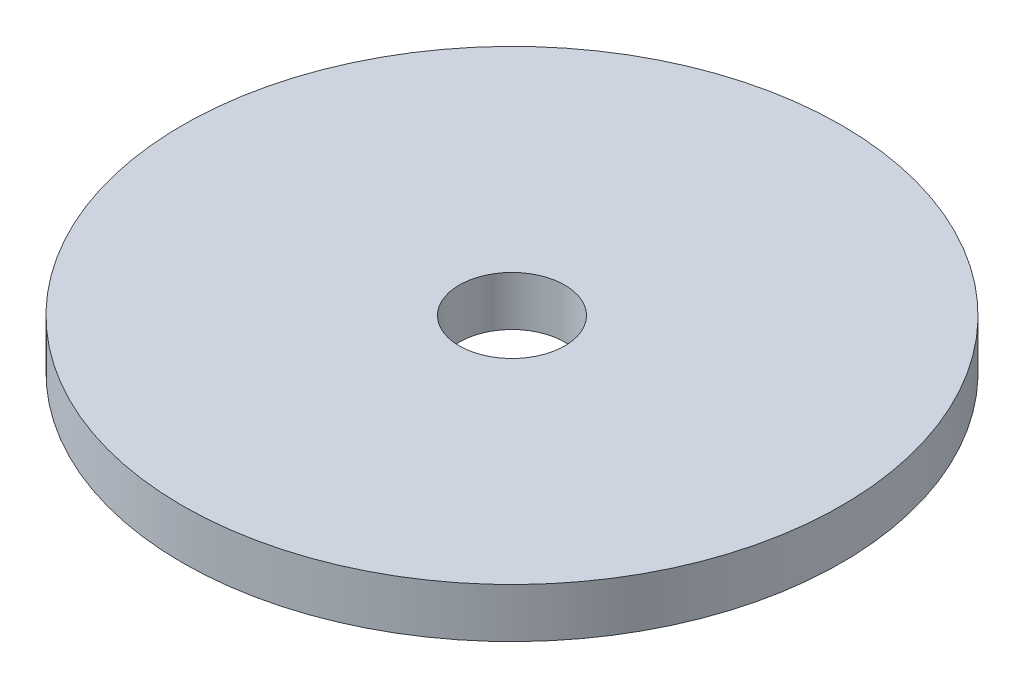
ISO-10303-21;
HEADER;
FILE_DESCRIPTION(('STEP AP214'),'2;1');
FILE_NAME('part.step','',(''),(''),'','','');
FILE_SCHEMA(('AUTOMOTIVE_DESIGN { 1 0 10303 214 1 1 1 1 }'));
ENDSEC;
DATA;
#1=APPLICATION_CONTEXT('core data for automotive mechanical design processes');
#2=APPLICATION_PROTOCOL_DEFINITION('international standard','automotive_design',2000,#1);
#3=PRODUCT_CONTEXT('',#1,'mechanical');
#4=PRODUCT('Part','Part','',(#3));
#5=PRODUCT_RELATED_PRODUCT_CATEGORY('part','',(#4));
#6=PRODUCT_DEFINITION_FORMATION('','',#4);
#7=PRODUCT_DEFINITION_CONTEXT('part definition',#1,'design');
#8=PRODUCT_DEFINITION('design','',#6,#7);
#9=PRODUCT_DEFINITION_SHAPE('','',#8);
#10=(LENGTH_UNIT() NAMED_UNIT(*) SI_UNIT(.MILLI.,.METRE.));
#11=(NAMED_UNIT(*) PLANE_ANGLE_UNIT() SI_UNIT($,.RADIAN.));
#12=(NAMED_UNIT(*) SI_UNIT($,.STERADIAN.) SOLID_ANGLE_UNIT());
#13=UNCERTAINTY_MEASURE_WITH_UNIT(LENGTH_MEASURE(1.E-05),#10,'distance_accuracy_value','');
#14=(GEOMETRIC_REPRESENTATION_CONTEXT(3) GLOBAL_UNCERTAINTY_ASSIGNED_CONTEXT((#13)) GLOBAL_UNIT_ASSIGNED_CONTEXT((#10,
#11,#12)) REPRESENTATION_CONTEXT('',''));
#15=CARTESIAN_POINT('',(0.,0.,0.));
#16=DIRECTION('',(0.,0.,1.));
#17=DIRECTION('',(1.,0.,0.));
#18=AXIS2_PLACEMENT_3D('',#15,#16,#17);
#19=CARTESIAN_POINT('',(0.,3.,0.));
#20=DIRECTION('',(0.,1.,0.));
#21=DIRECTION('',(0.,0.,1.));
#22=AXIS2_PLACEMENT_3D('',#19,#20,#21);
#23=PLANE('',#22);
#24=CARTESIAN_POINT('',(0.,3.,0.));
#25=DIRECTION('',(0.,1.,0.));
#26=DIRECTION('',(0.,0.,1.));
#27=AXIS2_PLACEMENT_3D('',#24,#25,#26);
#28=CIRCLE('',#27,20.);
#29=CARTESIAN_POINT('',(0.,3.,20.));
#30=VERTEX_POINT('',#29);
#31=EDGE_CURVE('E10',#30,#30,#28,.T.);
#32=ORIENTED_EDGE('',*,*,#31,.T.);
#33=EDGE_LOOP('',(#32));
#34=FACE_BOUND('',#33,.T.);
#35=CARTESIAN_POINT('',(0.,3.,0.));
#36=DIRECTION('',(0.,1.,0.));
#37=DIRECTION('',(0.,0.,1.));
#38=AXIS2_PLACEMENT_3D('',#35,#36,#37);
#39=CIRCLE('',#38,3.2);
#40=CARTESIAN_POINT('',(0.,3.,3.2));
#41=VERTEX_POINT('',#40);
#42=EDGE_CURVE('E50',#41,#41,#39,.T.);
#43=ORIENTED_EDGE('',*,*,#42,.F.);
#44=EDGE_LOOP('',(#43));
#45=FACE_BOUND('',#44,.T.);
#46=ADVANCED_FACE('F37',(#34,#45),#23,.T.);
#47=CARTESIAN_POINT('',(0.,0.,0.));
#48=DIRECTION('',(0.,1.,0.));
#49=DIRECTION('',(0.,0.,1.));
#50=AXIS2_PLACEMENT_3D('',#47,#48,#49);
#51=PLANE('',#50);
#52=CARTESIAN_POINT('',(0.,0.,0.));
#53=DIRECTION('',(0.,1.,0.));
#54=DIRECTION('',(0.,0.,1.));
#55=AXIS2_PLACEMENT_3D('',#52,#53,#54);
#56=CIRCLE('',#55,20.);
#57=CARTESIAN_POINT('',(0.,0.,20.));
#58=VERTEX_POINT('',#57);
#59=EDGE_CURVE('E41',#58,#58,#56,.T.);
#60=ORIENTED_EDGE('',*,*,#59,.F.);
#61=EDGE_LOOP('',(#60));
#62=FACE_BOUND('',#61,.T.);
#63=CARTESIAN_POINT('',(0.,0.,0.));
#64=DIRECTION('',(0.,1.,0.));
#65=DIRECTION('',(0.,0.,1.));
#66=AXIS2_PLACEMENT_3D('',#63,#64,#65);
#67=CIRCLE('',#66,3.2);
#68=CARTESIAN_POINT('',(0.,0.,3.2));
#69=VERTEX_POINT('',#68);
#70=EDGE_CURVE('E52',#69,#69,#67,.T.);
#71=ORIENTED_EDGE('',*,*,#70,.T.);
#72=EDGE_LOOP('',(#71));
#73=FACE_BOUND('',#72,.T.);
#74=ADVANCED_FACE('F64',(#62,#73),#51,.F.);
#75=CARTESIAN_POINT('',(0.,3.,0.));
#76=DIRECTION('',(0.,-1.,0.));
#77=DIRECTION('',(0.,0.,-1.));
#78=AXIS2_PLACEMENT_3D('',#75,#76,#77);
#79=CYLINDRICAL_SURFACE('',#78,20.);
#80=ORIENTED_EDGE('',*,*,#31,.F.);
#81=EDGE_LOOP('',(#80));
#82=FACE_BOUND('',#81,.T.);
#83=ORIENTED_EDGE('',*,*,#59,.T.);
#84=EDGE_LOOP('',(#83));
#85=FACE_BOUND('',#84,.T.);
#86=ADVANCED_FACE('F39',(#82,#85),#79,.T.);
#87=CARTESIAN_POINT('',(0.,3.,0.));
#88=DIRECTION('',(0.,-1.,0.));
#89=DIRECTION('',(0.,0.,-1.));
#90=AXIS2_PLACEMENT_3D('',#87,#88,#89);
#91=CYLINDRICAL_SURFACE('',#90,3.2);
#92=ORIENTED_EDGE('',*,*,#42,.T.);
#93=EDGE_LOOP('',(#92));
#94=FACE_BOUND('',#93,.T.);
#95=ORIENTED_EDGE('',*,*,#70,.F.);
#96=EDGE_LOOP('',(#95));
#97=FACE_BOUND('',#96,.T.);
#98=ADVANCED_FACE('F60',(#94,#97),#91,.F.);
#99=CLOSED_SHELL('',(#46,#74,#86,#98));
#100=MANIFOLD_SOLID_BREP('B2',#99);
#101=ADVANCED_BREP_SHAPE_REPRESENTATION('',(#18,#100),#14);
#102=SHAPE_DEFINITION_REPRESENTATION(#9,#101);
ENDSEC;
END-ISO-10303-21;
